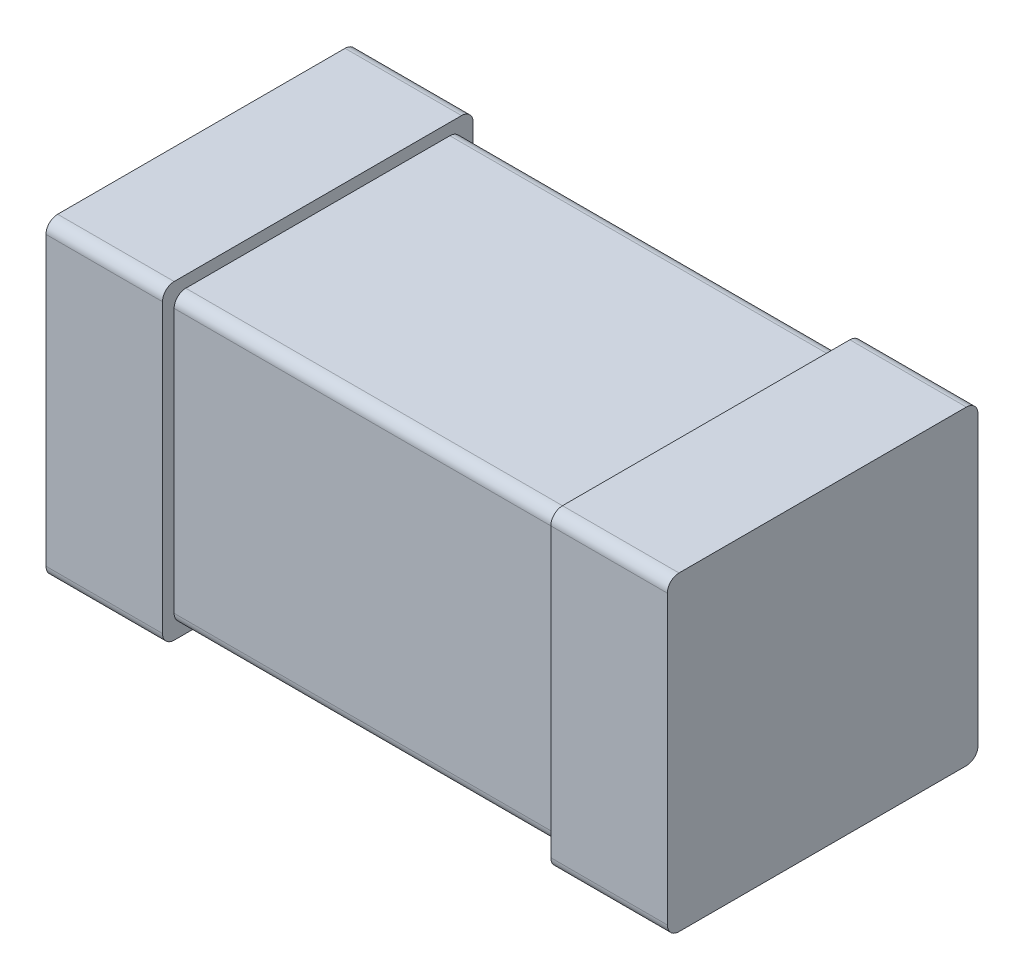
ISO-10303-21;
HEADER;
FILE_DESCRIPTION(('STEP AP214'),'2;1');
FILE_NAME('part.step','',(''),(''),'','','');
FILE_SCHEMA(('AUTOMOTIVE_DESIGN { 1 0 10303 214 1 1 1 1 }'));
ENDSEC;
DATA;
#1=APPLICATION_CONTEXT('core data for automotive mechanical design processes');
#2=APPLICATION_PROTOCOL_DEFINITION('international standard','automotive_design',2000,#1);
#3=PRODUCT_CONTEXT('',#1,'mechanical');
#4=PRODUCT('Part','Part','',(#3));
#5=PRODUCT_RELATED_PRODUCT_CATEGORY('part','',(#4));
#6=PRODUCT_DEFINITION_FORMATION('','',#4);
#7=PRODUCT_DEFINITION_CONTEXT('part definition',#1,'design');
#8=PRODUCT_DEFINITION('design','',#6,#7);
#9=PRODUCT_DEFINITION_SHAPE('','',#8);
#10=(LENGTH_UNIT() NAMED_UNIT(*) SI_UNIT(.MILLI.,.METRE.));
#11=(NAMED_UNIT(*) PLANE_ANGLE_UNIT() SI_UNIT($,.RADIAN.));
#12=(NAMED_UNIT(*) SI_UNIT($,.STERADIAN.) SOLID_ANGLE_UNIT());
#13=UNCERTAINTY_MEASURE_WITH_UNIT(LENGTH_MEASURE(1.E-05),#10,'distance_accuracy_value','');
#14=(GEOMETRIC_REPRESENTATION_CONTEXT(3) GLOBAL_UNCERTAINTY_ASSIGNED_CONTEXT((#13)) GLOBAL_UNIT_ASSIGNED_CONTEXT((#10,
#11,#12)) REPRESENTATION_CONTEXT('',''));
#15=CARTESIAN_POINT('',(0.,0.,0.));
#16=DIRECTION('',(0.,0.,1.));
#17=DIRECTION('',(1.,0.,0.));
#18=AXIS2_PLACEMENT_3D('',#15,#16,#17);
#19=CARTESIAN_POINT('',(-0.8,-0.37,0.03));
#20=DIRECTION('',(1.,0.,0.));
#21=DIRECTION('',(0.,0.,-1.));
#22=AXIS2_PLACEMENT_3D('',#19,#20,#21);
#23=CYLINDRICAL_SURFACE('',#22,0.03);
#24=CARTESIAN_POINT('',(-0.5,-0.37,0.03));
#25=DIRECTION('',(1.,0.,0.));
#26=DIRECTION('',(0.,0.,-1.));
#27=AXIS2_PLACEMENT_3D('',#24,#25,#26);
#28=CIRCLE('',#27,0.03);
#29=CARTESIAN_POINT('',(-0.5,-0.37,0.));
#30=VERTEX_POINT('',#29);
#31=CARTESIAN_POINT('',(-0.5,-0.4,0.03));
#32=VERTEX_POINT('',#31);
#33=EDGE_CURVE('E20',#30,#32,#28,.F.);
#34=ORIENTED_EDGE('',*,*,#33,.T.);
#35=DIRECTION('',(1.,0.,0.));
#36=VECTOR('',#35,1.);
#37=CARTESIAN_POINT('',(-0.8,-0.4,0.03));
#38=LINE('',#37,#36);
#39=CARTESIAN_POINT('',(-0.8,-0.4,0.03));
#40=VERTEX_POINT('',#39);
#41=EDGE_CURVE('E176',#32,#40,#38,.F.);
#42=ORIENTED_EDGE('',*,*,#41,.T.);
#43=CARTESIAN_POINT('',(-0.8,-0.37,0.03));
#44=DIRECTION('',(1.,0.,0.));
#45=DIRECTION('',(0.,0.,-1.));
#46=AXIS2_PLACEMENT_3D('',#43,#44,#45);
#47=CIRCLE('',#46,0.03);
#48=CARTESIAN_POINT('',(-0.8,-0.37,0.));
#49=VERTEX_POINT('',#48);
#50=EDGE_CURVE('E325',#40,#49,#47,.T.);
#51=ORIENTED_EDGE('',*,*,#50,.T.);
#52=DIRECTION('',(1.,0.,0.));
#53=VECTOR('',#52,1.);
#54=CARTESIAN_POINT('',(-0.8,-0.37,0.));
#55=LINE('',#54,#53);
#56=EDGE_CURVE('E178',#49,#30,#55,.T.);
#57=ORIENTED_EDGE('',*,*,#56,.T.);
#58=EDGE_LOOP('',(#34,#42,#51,#57));
#59=FACE_BOUND('',#58,.T.);
#60=ADVANCED_FACE('F17',(#59),#23,.T.);
#61=CARTESIAN_POINT('',(-0.8,0.37,0.03));
#62=DIRECTION('',(1.,0.,0.));
#63=DIRECTION('',(0.,0.,-1.));
#64=AXIS2_PLACEMENT_3D('',#61,#62,#63);
#65=CYLINDRICAL_SURFACE('',#64,0.03);
#66=DIRECTION('',(1.,0.,0.));
#67=VECTOR('',#66,1.);
#68=CARTESIAN_POINT('',(-0.8,0.37,0.));
#69=LINE('',#68,#67);
#70=CARTESIAN_POINT('',(-0.5,0.37,0.));
#71=VERTEX_POINT('',#70);
#72=CARTESIAN_POINT('',(-0.8,0.37,0.));
#73=VERTEX_POINT('',#72);
#74=EDGE_CURVE('E258',#71,#73,#69,.F.);
#75=ORIENTED_EDGE('',*,*,#74,.T.);
#76=CARTESIAN_POINT('',(-0.8,0.37,0.03));
#77=DIRECTION('',(1.,0.,0.));
#78=DIRECTION('',(0.,0.,-1.));
#79=AXIS2_PLACEMENT_3D('',#76,#77,#78);
#80=CIRCLE('',#79,0.03);
#81=CARTESIAN_POINT('',(-0.8,0.4,0.03));
#82=VERTEX_POINT('',#81);
#83=EDGE_CURVE('E322',#73,#82,#80,.T.);
#84=ORIENTED_EDGE('',*,*,#83,.T.);
#85=DIRECTION('',(1.,0.,0.));
#86=VECTOR('',#85,1.);
#87=CARTESIAN_POINT('',(-0.8,0.4,0.03));
#88=LINE('',#87,#86);
#89=CARTESIAN_POINT('',(-0.5,0.4,0.03));
#90=VERTEX_POINT('',#89);
#91=EDGE_CURVE('E255',#90,#82,#88,.F.);
#92=ORIENTED_EDGE('',*,*,#91,.F.);
#93=CARTESIAN_POINT('',(-0.5,0.37,0.03));
#94=DIRECTION('',(1.,0.,0.));
#95=DIRECTION('',(0.,0.,-1.));
#96=AXIS2_PLACEMENT_3D('',#93,#94,#95);
#97=CIRCLE('',#96,0.03);
#98=EDGE_CURVE('E180',#90,#71,#97,.F.);
#99=ORIENTED_EDGE('',*,*,#98,.T.);
#100=EDGE_LOOP('',(#75,#84,#92,#99));
#101=FACE_BOUND('',#100,.T.);
#102=ADVANCED_FACE('F329',(#101),#65,.T.);
#103=CARTESIAN_POINT('',(-0.8,-0.4,0.));
#104=DIRECTION('',(1.,0.,0.));
#105=DIRECTION('',(0.,0.,-1.));
#106=AXIS2_PLACEMENT_3D('',#103,#104,#105);
#107=PLANE('',#106);
#108=DIRECTION('',(0.,1.,0.));
#109=VECTOR('',#108,1.);
#110=CARTESIAN_POINT('',(-0.8,-0.4,0.8));
#111=LINE('',#110,#109);
#112=CARTESIAN_POINT('',(-0.8,0.37,0.8));
#113=VERTEX_POINT('',#112);
#114=CARTESIAN_POINT('',(-0.8,-0.37,0.8));
#115=VERTEX_POINT('',#114);
#116=EDGE_CURVE('E254',#113,#115,#111,.F.);
#117=ORIENTED_EDGE('',*,*,#116,.F.);
#118=CARTESIAN_POINT('',(-0.8,0.37,0.77));
#119=DIRECTION('',(1.,0.,0.));
#120=DIRECTION('',(0.,0.,-1.));
#121=AXIS2_PLACEMENT_3D('',#118,#119,#120);
#122=CIRCLE('',#121,0.03);
#123=CARTESIAN_POINT('',(-0.8,0.4,0.77));
#124=VERTEX_POINT('',#123);
#125=EDGE_CURVE('E317',#124,#113,#122,.T.);
#126=ORIENTED_EDGE('',*,*,#125,.F.);
#127=DIRECTION('',(0.,0.,1.));
#128=VECTOR('',#127,1.);
#129=CARTESIAN_POINT('',(-0.8,0.4,0.));
#130=LINE('',#129,#128);
#131=EDGE_CURVE('E257',#82,#124,#130,.T.);
#132=ORIENTED_EDGE('',*,*,#131,.F.);
#133=ORIENTED_EDGE('',*,*,#83,.F.);
#134=DIRECTION('',(0.,1.,0.));
#135=VECTOR('',#134,1.);
#136=CARTESIAN_POINT('',(-0.8,-0.4,0.));
#137=LINE('',#136,#135);
#138=EDGE_CURVE('E263',#73,#49,#137,.F.);
#139=ORIENTED_EDGE('',*,*,#138,.T.);
#140=ORIENTED_EDGE('',*,*,#50,.F.);
#141=DIRECTION('',(0.,0.,1.));
#142=VECTOR('',#141,1.);
#143=CARTESIAN_POINT('',(-0.8,-0.4,0.));
#144=LINE('',#143,#142);
#145=CARTESIAN_POINT('',(-0.8,-0.4,0.77));
#146=VERTEX_POINT('',#145);
#147=EDGE_CURVE('E188',#40,#146,#144,.T.);
#148=ORIENTED_EDGE('',*,*,#147,.T.);
#149=CARTESIAN_POINT('',(-0.8,-0.37,0.77));
#150=DIRECTION('',(1.,0.,0.));
#151=DIRECTION('',(0.,0.,-1.));
#152=AXIS2_PLACEMENT_3D('',#149,#150,#151);
#153=CIRCLE('',#152,0.03);
#154=EDGE_CURVE('E319',#115,#146,#153,.T.);
#155=ORIENTED_EDGE('',*,*,#154,.F.);
#156=EDGE_LOOP('',(#117,#126,#132,#133,#139,#140,#148,#155));
#157=FACE_BOUND('',#156,.T.);
#158=ADVANCED_FACE('F337',(#157),#107,.F.);
#159=CARTESIAN_POINT('',(-0.8,-0.37,0.77));
#160=DIRECTION('',(1.,0.,0.));
#161=DIRECTION('',(0.,0.,-1.));
#162=AXIS2_PLACEMENT_3D('',#159,#160,#161);
#163=CYLINDRICAL_SURFACE('',#162,0.03);
#164=DIRECTION('',(1.,0.,0.));
#165=VECTOR('',#164,1.);
#166=CARTESIAN_POINT('',(-0.8,-0.37,0.8));
#167=LINE('',#166,#165);
#168=CARTESIAN_POINT('',(-0.5,-0.37,0.8));
#169=VERTEX_POINT('',#168);
#170=EDGE_CURVE('E251',#115,#169,#167,.T.);
#171=ORIENTED_EDGE('',*,*,#170,.F.);
#172=ORIENTED_EDGE('',*,*,#154,.T.);
#173=DIRECTION('',(1.,0.,0.));
#174=VECTOR('',#173,1.);
#175=CARTESIAN_POINT('',(-0.8,-0.4,0.77));
#176=LINE('',#175,#174);
#177=CARTESIAN_POINT('',(-0.5,-0.4,0.77));
#178=VERTEX_POINT('',#177);
#179=EDGE_CURVE('E266',#146,#178,#176,.T.);
#180=ORIENTED_EDGE('',*,*,#179,.T.);
#181=CARTESIAN_POINT('',(-0.5,-0.37,0.77));
#182=DIRECTION('',(1.,0.,0.));
#183=DIRECTION('',(0.,0.,-1.));
#184=AXIS2_PLACEMENT_3D('',#181,#182,#183);
#185=CIRCLE('',#184,0.03);
#186=EDGE_CURVE('E193',#178,#169,#185,.F.);
#187=ORIENTED_EDGE('',*,*,#186,.T.);
#188=EDGE_LOOP('',(#171,#172,#180,#187));
#189=FACE_BOUND('',#188,.T.);
#190=ADVANCED_FACE('F480',(#189),#163,.T.);
#191=CARTESIAN_POINT('',(-0.8,0.37,0.77));
#192=DIRECTION('',(1.,0.,0.));
#193=DIRECTION('',(0.,0.,-1.));
#194=AXIS2_PLACEMENT_3D('',#191,#192,#193);
#195=CYLINDRICAL_SURFACE('',#194,0.03);
#196=CARTESIAN_POINT('',(-0.5,0.37,0.77));
#197=DIRECTION('',(1.,0.,0.));
#198=DIRECTION('',(0.,0.,-1.));
#199=AXIS2_PLACEMENT_3D('',#196,#197,#198);
#200=CIRCLE('',#199,0.03);
#201=CARTESIAN_POINT('',(-0.5,0.37,0.8));
#202=VERTEX_POINT('',#201);
#203=CARTESIAN_POINT('',(-0.5,0.4,0.77));
#204=VERTEX_POINT('',#203);
#205=EDGE_CURVE('E315',#202,#204,#200,.F.);
#206=ORIENTED_EDGE('',*,*,#205,.T.);
#207=DIRECTION('',(1.,0.,0.));
#208=VECTOR('',#207,1.);
#209=CARTESIAN_POINT('',(-0.8,0.4,0.77));
#210=LINE('',#209,#208);
#211=EDGE_CURVE('E259',#124,#204,#210,.T.);
#212=ORIENTED_EDGE('',*,*,#211,.F.);
#213=ORIENTED_EDGE('',*,*,#125,.T.);
#214=DIRECTION('',(1.,0.,0.));
#215=VECTOR('',#214,1.);
#216=CARTESIAN_POINT('',(-0.8,0.37,0.8));
#217=LINE('',#216,#215);
#218=EDGE_CURVE('E248',#202,#113,#217,.F.);
#219=ORIENTED_EDGE('',*,*,#218,.F.);
#220=EDGE_LOOP('',(#206,#212,#213,#219));
#221=FACE_BOUND('',#220,.T.);
#222=ADVANCED_FACE('F476',(#221),#195,.T.);
#223=CARTESIAN_POINT('',(0.5,-0.37,0.03));
#224=DIRECTION('',(1.,0.,0.));
#225=DIRECTION('',(0.,0.,-1.));
#226=AXIS2_PLACEMENT_3D('',#223,#224,#225);
#227=CYLINDRICAL_SURFACE('',#226,0.03);
#228=CARTESIAN_POINT('',(0.8,-0.37,0.03));
#229=DIRECTION('',(1.,0.,0.));
#230=DIRECTION('',(0.,0.,-1.));
#231=AXIS2_PLACEMENT_3D('',#228,#229,#230);
#232=CIRCLE('',#231,0.03);
#233=CARTESIAN_POINT('',(0.8,-0.4,0.03));
#234=VERTEX_POINT('',#233);
#235=CARTESIAN_POINT('',(0.8,-0.37,0.));
#236=VERTEX_POINT('',#235);
#237=EDGE_CURVE('E307',#234,#236,#232,.T.);
#238=ORIENTED_EDGE('',*,*,#237,.F.);
#239=DIRECTION('',(1.,0.,0.));
#240=VECTOR('',#239,1.);
#241=CARTESIAN_POINT('',(0.5,-0.4,0.03));
#242=LINE('',#241,#240);
#243=CARTESIAN_POINT('',(0.5,-0.4,0.03));
#244=VERTEX_POINT('',#243);
#245=EDGE_CURVE('E244',#234,#244,#242,.F.);
#246=ORIENTED_EDGE('',*,*,#245,.T.);
#247=CARTESIAN_POINT('',(0.5,-0.37,0.03));
#248=DIRECTION('',(1.,0.,0.));
#249=DIRECTION('',(0.,0.,-1.));
#250=AXIS2_PLACEMENT_3D('',#247,#248,#249);
#251=CIRCLE('',#250,0.03);
#252=CARTESIAN_POINT('',(0.5,-0.37,0.));
#253=VERTEX_POINT('',#252);
#254=EDGE_CURVE('E313',#244,#253,#251,.T.);
#255=ORIENTED_EDGE('',*,*,#254,.T.);
#256=DIRECTION('',(1.,0.,0.));
#257=VECTOR('',#256,1.);
#258=CARTESIAN_POINT('',(0.5,-0.37,0.));
#259=LINE('',#258,#257);
#260=EDGE_CURVE('E234',#253,#236,#259,.T.);
#261=ORIENTED_EDGE('',*,*,#260,.T.);
#262=EDGE_LOOP('',(#238,#246,#255,#261));
#263=FACE_BOUND('',#262,.T.);
#264=ADVANCED_FACE('F472',(#263),#227,.T.);
#265=CARTESIAN_POINT('',(0.5,0.37,0.03));
#266=DIRECTION('',(1.,0.,0.));
#267=DIRECTION('',(0.,0.,-1.));
#268=AXIS2_PLACEMENT_3D('',#265,#266,#267);
#269=CYLINDRICAL_SURFACE('',#268,0.03);
#270=DIRECTION('',(1.,0.,0.));
#271=VECTOR('',#270,1.);
#272=CARTESIAN_POINT('',(0.5,0.37,0.));
#273=LINE('',#272,#271);
#274=CARTESIAN_POINT('',(0.8,0.37,0.));
#275=VERTEX_POINT('',#274);
#276=CARTESIAN_POINT('',(0.5,0.37,0.));
#277=VERTEX_POINT('',#276);
#278=EDGE_CURVE('E239',#275,#277,#273,.F.);
#279=ORIENTED_EDGE('',*,*,#278,.T.);
#280=CARTESIAN_POINT('',(0.5,0.37,0.03));
#281=DIRECTION('',(1.,0.,0.));
#282=DIRECTION('',(0.,0.,-1.));
#283=AXIS2_PLACEMENT_3D('',#280,#281,#282);
#284=CIRCLE('',#283,0.03);
#285=CARTESIAN_POINT('',(0.5,0.4,0.03));
#286=VERTEX_POINT('',#285);
#287=EDGE_CURVE('E311',#277,#286,#284,.T.);
#288=ORIENTED_EDGE('',*,*,#287,.T.);
#289=DIRECTION('',(1.,0.,0.));
#290=VECTOR('',#289,1.);
#291=CARTESIAN_POINT('',(0.5,0.4,0.03));
#292=LINE('',#291,#290);
#293=CARTESIAN_POINT('',(0.8,0.4,0.03));
#294=VERTEX_POINT('',#293);
#295=EDGE_CURVE('E228',#294,#286,#292,.F.);
#296=ORIENTED_EDGE('',*,*,#295,.F.);
#297=CARTESIAN_POINT('',(0.8,0.37,0.03));
#298=DIRECTION('',(1.,0.,0.));
#299=DIRECTION('',(0.,0.,-1.));
#300=AXIS2_PLACEMENT_3D('',#297,#298,#299);
#301=CIRCLE('',#300,0.03);
#302=EDGE_CURVE('E305',#275,#294,#301,.T.);
#303=ORIENTED_EDGE('',*,*,#302,.F.);
#304=EDGE_LOOP('',(#279,#288,#296,#303));
#305=FACE_BOUND('',#304,.T.);
#306=ADVANCED_FACE('F468',(#305),#269,.T.);
#307=CARTESIAN_POINT('',(0.5,-0.37,0.77));
#308=DIRECTION('',(1.,0.,0.));
#309=DIRECTION('',(0.,0.,-1.));
#310=AXIS2_PLACEMENT_3D('',#307,#308,#309);
#311=CYLINDRICAL_SURFACE('',#310,0.03);
#312=DIRECTION('',(1.,0.,0.));
#313=VECTOR('',#312,1.);
#314=CARTESIAN_POINT('',(0.5,-0.37,0.8));
#315=LINE('',#314,#313);
#316=CARTESIAN_POINT('',(0.5,-0.37,0.8));
#317=VERTEX_POINT('',#316);
#318=CARTESIAN_POINT('',(0.8,-0.37,0.8));
#319=VERTEX_POINT('',#318);
#320=EDGE_CURVE('E225',#317,#319,#315,.T.);
#321=ORIENTED_EDGE('',*,*,#320,.F.);
#322=CARTESIAN_POINT('',(0.5,-0.37,0.77));
#323=DIRECTION('',(1.,0.,0.));
#324=DIRECTION('',(0.,0.,-1.));
#325=AXIS2_PLACEMENT_3D('',#322,#323,#324);
#326=CIRCLE('',#325,0.03);
#327=CARTESIAN_POINT('',(0.5,-0.4,0.77));
#328=VERTEX_POINT('',#327);
#329=EDGE_CURVE('E309',#317,#328,#326,.T.);
#330=ORIENTED_EDGE('',*,*,#329,.T.);
#331=DIRECTION('',(1.,0.,0.));
#332=VECTOR('',#331,1.);
#333=CARTESIAN_POINT('',(0.5,-0.4,0.77));
#334=LINE('',#333,#332);
#335=CARTESIAN_POINT('',(0.8,-0.4,0.77));
#336=VERTEX_POINT('',#335);
#337=EDGE_CURVE('E238',#328,#336,#334,.T.);
#338=ORIENTED_EDGE('',*,*,#337,.T.);
#339=CARTESIAN_POINT('',(0.8,-0.37,0.77));
#340=DIRECTION('',(1.,0.,0.));
#341=DIRECTION('',(0.,0.,-1.));
#342=AXIS2_PLACEMENT_3D('',#339,#340,#341);
#343=CIRCLE('',#342,0.03);
#344=EDGE_CURVE('E303',#319,#336,#343,.T.);
#345=ORIENTED_EDGE('',*,*,#344,.F.);
#346=EDGE_LOOP('',(#321,#330,#338,#345));
#347=FACE_BOUND('',#346,.T.);
#348=ADVANCED_FACE('F464',(#347),#311,.T.);
#349=CARTESIAN_POINT('',(0.8,-0.4,0.));
#350=DIRECTION('',(1.,0.,0.));
#351=DIRECTION('',(0.,0.,-1.));
#352=AXIS2_PLACEMENT_3D('',#349,#350,#351);
#353=PLANE('',#352);
#354=DIRECTION('',(0.,1.,0.));
#355=VECTOR('',#354,1.);
#356=CARTESIAN_POINT('',(0.8,-0.4,0.8));
#357=LINE('',#356,#355);
#358=CARTESIAN_POINT('',(0.8,0.37,0.8));
#359=VERTEX_POINT('',#358);
#360=EDGE_CURVE('E224',#319,#359,#357,.T.);
#361=ORIENTED_EDGE('',*,*,#360,.F.);
#362=ORIENTED_EDGE('',*,*,#344,.T.);
#363=DIRECTION('',(0.,0.,1.));
#364=VECTOR('',#363,1.);
#365=CARTESIAN_POINT('',(0.8,-0.4,0.));
#366=LINE('',#365,#364);
#367=EDGE_CURVE('E247',#336,#234,#366,.F.);
#368=ORIENTED_EDGE('',*,*,#367,.T.);
#369=ORIENTED_EDGE('',*,*,#237,.T.);
#370=DIRECTION('',(0.,1.,0.));
#371=VECTOR('',#370,1.);
#372=CARTESIAN_POINT('',(0.8,-0.4,0.));
#373=LINE('',#372,#371);
#374=EDGE_CURVE('E237',#236,#275,#373,.T.);
#375=ORIENTED_EDGE('',*,*,#374,.T.);
#376=ORIENTED_EDGE('',*,*,#302,.T.);
#377=DIRECTION('',(0.,0.,1.));
#378=VECTOR('',#377,1.);
#379=CARTESIAN_POINT('',(0.8,0.4,0.));
#380=LINE('',#379,#378);
#381=CARTESIAN_POINT('',(0.8,0.4,0.77));
#382=VERTEX_POINT('',#381);
#383=EDGE_CURVE('E231',#382,#294,#380,.F.);
#384=ORIENTED_EDGE('',*,*,#383,.F.);
#385=CARTESIAN_POINT('',(0.8,0.37,0.77));
#386=DIRECTION('',(1.,0.,0.));
#387=DIRECTION('',(0.,0.,-1.));
#388=AXIS2_PLACEMENT_3D('',#385,#386,#387);
#389=CIRCLE('',#388,0.03);
#390=EDGE_CURVE('E299',#359,#382,#389,.F.);
#391=ORIENTED_EDGE('',*,*,#390,.F.);
#392=EDGE_LOOP('',(#361,#362,#368,#369,#375,#376,#384,#391));
#393=FACE_BOUND('',#392,.T.);
#394=ADVANCED_FACE('F460',(#393),#353,.T.);
#395=CARTESIAN_POINT('',(0.5,0.37,0.77));
#396=DIRECTION('',(1.,0.,0.));
#397=DIRECTION('',(0.,0.,-1.));
#398=AXIS2_PLACEMENT_3D('',#395,#396,#397);
#399=CYLINDRICAL_SURFACE('',#398,0.03);
#400=ORIENTED_EDGE('',*,*,#390,.T.);
#401=DIRECTION('',(1.,0.,0.));
#402=VECTOR('',#401,1.);
#403=CARTESIAN_POINT('',(0.5,0.4,0.77));
#404=LINE('',#403,#402);
#405=CARTESIAN_POINT('',(0.5,0.4,0.77));
#406=VERTEX_POINT('',#405);
#407=EDGE_CURVE('E227',#406,#382,#404,.T.);
#408=ORIENTED_EDGE('',*,*,#407,.F.);
#409=CARTESIAN_POINT('',(0.5,0.37,0.77));
#410=DIRECTION('',(1.,0.,0.));
#411=DIRECTION('',(0.,0.,-1.));
#412=AXIS2_PLACEMENT_3D('',#409,#410,#411);
#413=CIRCLE('',#412,0.03);
#414=CARTESIAN_POINT('',(0.5,0.37,0.8));
#415=VERTEX_POINT('',#414);
#416=EDGE_CURVE('E301',#406,#415,#413,.T.);
#417=ORIENTED_EDGE('',*,*,#416,.T.);
#418=DIRECTION('',(1.,0.,0.));
#419=VECTOR('',#418,1.);
#420=CARTESIAN_POINT('',(0.5,0.37,0.8));
#421=LINE('',#420,#419);
#422=EDGE_CURVE('E216',#359,#415,#421,.F.);
#423=ORIENTED_EDGE('',*,*,#422,.F.);
#424=EDGE_LOOP('',(#400,#408,#417,#423));
#425=FACE_BOUND('',#424,.T.);
#426=ADVANCED_FACE('F456',(#425),#399,.T.);
#427=CARTESIAN_POINT('',(-0.5,-0.34,0.74));
#428=DIRECTION('',(1.,0.,0.));
#429=DIRECTION('',(0.,0.,-1.));
#430=AXIS2_PLACEMENT_3D('',#427,#428,#429);
#431=CYLINDRICAL_SURFACE('',#430,0.03);
#432=DIRECTION('',(1.,0.,0.));
#433=VECTOR('',#432,1.);
#434=CARTESIAN_POINT('',(-0.5,-0.34,0.77));
#435=LINE('',#434,#433);
#436=CARTESIAN_POINT('',(-0.5,-0.34,0.77));
#437=VERTEX_POINT('',#436);
#438=CARTESIAN_POINT('',(0.5,-0.34,0.77));
#439=VERTEX_POINT('',#438);
#440=EDGE_CURVE('E208',#437,#439,#435,.T.);
#441=ORIENTED_EDGE('',*,*,#440,.F.);
#442=CARTESIAN_POINT('',(-0.5,-0.34,0.74));
#443=DIRECTION('',(1.,0.,0.));
#444=DIRECTION('',(0.,0.,-1.));
#445=AXIS2_PLACEMENT_3D('',#442,#443,#444);
#446=CIRCLE('',#445,0.03);
#447=CARTESIAN_POINT('',(-0.5,-0.37,0.74));
#448=VERTEX_POINT('',#447);
#449=EDGE_CURVE('E295',#437,#448,#446,.T.);
#450=ORIENTED_EDGE('',*,*,#449,.T.);
#451=DIRECTION('',(1.,0.,0.));
#452=VECTOR('',#451,1.);
#453=CARTESIAN_POINT('',(-0.5,-0.37,0.74));
#454=LINE('',#453,#452);
#455=CARTESIAN_POINT('',(0.5,-0.37,0.74));
#456=VERTEX_POINT('',#455);
#457=EDGE_CURVE('E211',#448,#456,#454,.T.);
#458=ORIENTED_EDGE('',*,*,#457,.T.);
#459=CARTESIAN_POINT('',(0.5,-0.34,0.74));
#460=DIRECTION('',(1.,0.,0.));
#461=DIRECTION('',(0.,0.,-1.));
#462=AXIS2_PLACEMENT_3D('',#459,#460,#461);
#463=CIRCLE('',#462,0.03);
#464=EDGE_CURVE('E297',#456,#439,#463,.F.);
#465=ORIENTED_EDGE('',*,*,#464,.T.);
#466=EDGE_LOOP('',(#441,#450,#458,#465));
#467=FACE_BOUND('',#466,.T.);
#468=ADVANCED_FACE('F452',(#467),#431,.T.);
#469=CARTESIAN_POINT('',(-0.5,0.34,0.74));
#470=DIRECTION('',(1.,0.,0.));
#471=DIRECTION('',(0.,0.,-1.));
#472=AXIS2_PLACEMENT_3D('',#469,#470,#471);
#473=CYLINDRICAL_SURFACE('',#472,0.03);
#474=CARTESIAN_POINT('',(0.5,0.34,0.74));
#475=DIRECTION('',(1.,0.,0.));
#476=DIRECTION('',(0.,0.,-1.));
#477=AXIS2_PLACEMENT_3D('',#474,#475,#476);
#478=CIRCLE('',#477,0.03);
#479=CARTESIAN_POINT('',(0.5,0.34,0.77));
#480=VERTEX_POINT('',#479);
#481=CARTESIAN_POINT('',(0.5,0.37,0.74));
#482=VERTEX_POINT('',#481);
#483=EDGE_CURVE('E189',#480,#482,#478,.F.);
#484=ORIENTED_EDGE('',*,*,#483,.T.);
#485=DIRECTION('',(1.,0.,0.));
#486=VECTOR('',#485,1.);
#487=CARTESIAN_POINT('',(-0.5,0.37,0.74));
#488=LINE('',#487,#486);
#489=CARTESIAN_POINT('',(-0.5,0.37,0.74));
#490=VERTEX_POINT('',#489);
#491=EDGE_CURVE('E196',#490,#482,#488,.T.);
#492=ORIENTED_EDGE('',*,*,#491,.F.);
#493=CARTESIAN_POINT('',(-0.5,0.34,0.74));
#494=DIRECTION('',(1.,0.,0.));
#495=DIRECTION('',(0.,0.,-1.));
#496=AXIS2_PLACEMENT_3D('',#493,#494,#495);
#497=CIRCLE('',#496,0.03);
#498=CARTESIAN_POINT('',(-0.5,0.34,0.77));
#499=VERTEX_POINT('',#498);
#500=EDGE_CURVE('E293',#490,#499,#497,.T.);
#501=ORIENTED_EDGE('',*,*,#500,.T.);
#502=DIRECTION('',(1.,0.,0.));
#503=VECTOR('',#502,1.);
#504=CARTESIAN_POINT('',(-0.5,0.34,0.77));
#505=LINE('',#504,#503);
#506=EDGE_CURVE('E201',#480,#499,#505,.F.);
#507=ORIENTED_EDGE('',*,*,#506,.F.);
#508=EDGE_LOOP('',(#484,#492,#501,#507));
#509=FACE_BOUND('',#508,.T.);
#510=ADVANCED_FACE('F449',(#509),#473,.T.);
#511=CARTESIAN_POINT('',(-0.8,-0.4,0.));
#512=DIRECTION('',(0.,1.,0.));
#513=DIRECTION('',(0.,0.,1.));
#514=AXIS2_PLACEMENT_3D('',#511,#512,#513);
#515=PLANE('',#514);
#516=ORIENTED_EDGE('',*,*,#147,.F.);
#517=ORIENTED_EDGE('',*,*,#41,.F.);
#518=DIRECTION('',(0.,0.,-1.));
#519=VECTOR('',#518,1.);
#520=CARTESIAN_POINT('',(-0.5,-0.4,0.));
#521=LINE('',#520,#519);
#522=EDGE_CURVE('E186',#178,#32,#521,.T.);
#523=ORIENTED_EDGE('',*,*,#522,.F.);
#524=ORIENTED_EDGE('',*,*,#179,.F.);
#525=EDGE_LOOP('',(#516,#517,#523,#524));
#526=FACE_BOUND('',#525,.T.);
#527=ADVANCED_FACE('F184',(#526),#515,.F.);
#528=CARTESIAN_POINT('',(-0.8,-0.4,0.));
#529=DIRECTION('',(0.,0.,1.));
#530=DIRECTION('',(1.,0.,0.));
#531=AXIS2_PLACEMENT_3D('',#528,#529,#530);
#532=PLANE('',#531);
#533=DIRECTION('',(0.,1.,0.));
#534=VECTOR('',#533,1.);
#535=CARTESIAN_POINT('',(-0.5,-0.4,0.));
#536=LINE('',#535,#534);
#537=EDGE_CURVE('E195',#30,#71,#536,.T.);
#538=ORIENTED_EDGE('',*,*,#537,.F.);
#539=ORIENTED_EDGE('',*,*,#56,.F.);
#540=ORIENTED_EDGE('',*,*,#138,.F.);
#541=ORIENTED_EDGE('',*,*,#74,.F.);
#542=EDGE_LOOP('',(#538,#539,#540,#541));
#543=FACE_BOUND('',#542,.T.);
#544=ADVANCED_FACE('F334',(#543),#532,.F.);
#545=CARTESIAN_POINT('',(-0.8,0.4,0.));
#546=DIRECTION('',(0.,1.,0.));
#547=DIRECTION('',(0.,0.,1.));
#548=AXIS2_PLACEMENT_3D('',#545,#546,#547);
#549=PLANE('',#548);
#550=ORIENTED_EDGE('',*,*,#131,.T.);
#551=ORIENTED_EDGE('',*,*,#211,.T.);
#552=DIRECTION('',(0.,0.,-1.));
#553=VECTOR('',#552,1.);
#554=CARTESIAN_POINT('',(-0.5,0.4,0.));
#555=LINE('',#554,#553);
#556=EDGE_CURVE('E198',#90,#204,#555,.F.);
#557=ORIENTED_EDGE('',*,*,#556,.F.);
#558=ORIENTED_EDGE('',*,*,#91,.T.);
#559=EDGE_LOOP('',(#550,#551,#557,#558));
#560=FACE_BOUND('',#559,.T.);
#561=ADVANCED_FACE('F342',(#560),#549,.T.);
#562=CARTESIAN_POINT('',(-0.8,-0.4,0.8));
#563=DIRECTION('',(0.,0.,1.));
#564=DIRECTION('',(1.,0.,0.));
#565=AXIS2_PLACEMENT_3D('',#562,#563,#564);
#566=PLANE('',#565);
#567=DIRECTION('',(0.,1.,0.));
#568=VECTOR('',#567,1.);
#569=CARTESIAN_POINT('',(-0.5,-0.4,0.8));
#570=LINE('',#569,#568);
#571=EDGE_CURVE('E343',#202,#169,#570,.F.);
#572=ORIENTED_EDGE('',*,*,#571,.F.);
#573=ORIENTED_EDGE('',*,*,#218,.T.);
#574=ORIENTED_EDGE('',*,*,#116,.T.);
#575=ORIENTED_EDGE('',*,*,#170,.T.);
#576=EDGE_LOOP('',(#572,#573,#574,#575));
#577=FACE_BOUND('',#576,.T.);
#578=ADVANCED_FACE('F438',(#577),#566,.T.);
#579=CARTESIAN_POINT('',(0.5,-0.4,0.));
#580=DIRECTION('',(0.,1.,0.));
#581=DIRECTION('',(0.,0.,1.));
#582=AXIS2_PLACEMENT_3D('',#579,#580,#581);
#583=PLANE('',#582);
#584=DIRECTION('',(0.,0.,-1.));
#585=VECTOR('',#584,1.);
#586=CARTESIAN_POINT('',(0.5,-0.4,0.));
#587=LINE('',#586,#585);
#588=EDGE_CURVE('E220',#328,#244,#587,.T.);
#589=ORIENTED_EDGE('',*,*,#588,.T.);
#590=ORIENTED_EDGE('',*,*,#245,.F.);
#591=ORIENTED_EDGE('',*,*,#367,.F.);
#592=ORIENTED_EDGE('',*,*,#337,.F.);
#593=EDGE_LOOP('',(#589,#590,#591,#592));
#594=FACE_BOUND('',#593,.T.);
#595=ADVANCED_FACE('F434',(#594),#583,.F.);
#596=CARTESIAN_POINT('',(0.5,-0.4,0.));
#597=DIRECTION('',(0.,0.,1.));
#598=DIRECTION('',(1.,0.,0.));
#599=AXIS2_PLACEMENT_3D('',#596,#597,#598);
#600=PLANE('',#599);
#601=ORIENTED_EDGE('',*,*,#374,.F.);
#602=ORIENTED_EDGE('',*,*,#260,.F.);
#603=DIRECTION('',(0.,1.,0.));
#604=VECTOR('',#603,1.);
#605=CARTESIAN_POINT('',(0.5,-0.4,0.));
#606=LINE('',#605,#604);
#607=EDGE_CURVE('E363',#253,#277,#606,.T.);
#608=ORIENTED_EDGE('',*,*,#607,.T.);
#609=ORIENTED_EDGE('',*,*,#278,.F.);
#610=EDGE_LOOP('',(#601,#602,#608,#609));
#611=FACE_BOUND('',#610,.T.);
#612=ADVANCED_FACE('F430',(#611),#600,.F.);
#613=CARTESIAN_POINT('',(0.5,0.4,0.));
#614=DIRECTION('',(0.,1.,0.));
#615=DIRECTION('',(0.,0.,1.));
#616=AXIS2_PLACEMENT_3D('',#613,#614,#615);
#617=PLANE('',#616);
#618=DIRECTION('',(0.,0.,-1.));
#619=VECTOR('',#618,1.);
#620=CARTESIAN_POINT('',(0.5,0.4,0.));
#621=LINE('',#620,#619);
#622=EDGE_CURVE('E366',#286,#406,#621,.F.);
#623=ORIENTED_EDGE('',*,*,#622,.T.);
#624=ORIENTED_EDGE('',*,*,#407,.T.);
#625=ORIENTED_EDGE('',*,*,#383,.T.);
#626=ORIENTED_EDGE('',*,*,#295,.T.);
#627=EDGE_LOOP('',(#623,#624,#625,#626));
#628=FACE_BOUND('',#627,.T.);
#629=ADVANCED_FACE('F426',(#628),#617,.T.);
#630=CARTESIAN_POINT('',(0.5,-0.4,0.8));
#631=DIRECTION('',(0.,0.,1.));
#632=DIRECTION('',(1.,0.,0.));
#633=AXIS2_PLACEMENT_3D('',#630,#631,#632);
#634=PLANE('',#633);
#635=ORIENTED_EDGE('',*,*,#360,.T.);
#636=ORIENTED_EDGE('',*,*,#422,.T.);
#637=DIRECTION('',(0.,1.,0.));
#638=VECTOR('',#637,1.);
#639=CARTESIAN_POINT('',(0.5,-0.4,0.8));
#640=LINE('',#639,#638);
#641=EDGE_CURVE('E289',#415,#317,#640,.F.);
#642=ORIENTED_EDGE('',*,*,#641,.T.);
#643=ORIENTED_EDGE('',*,*,#320,.T.);
#644=EDGE_LOOP('',(#635,#636,#642,#643));
#645=FACE_BOUND('',#644,.T.);
#646=ADVANCED_FACE('F422',(#645),#634,.T.);
#647=CARTESIAN_POINT('',(-0.5,-0.37,0.03));
#648=DIRECTION('',(0.,1.,0.));
#649=DIRECTION('',(0.,0.,1.));
#650=AXIS2_PLACEMENT_3D('',#647,#648,#649);
#651=PLANE('',#650);
#652=DIRECTION('',(0.,0.,-1.));
#653=VECTOR('',#652,1.);
#654=CARTESIAN_POINT('',(-0.5,-0.37,0.));
#655=LINE('',#654,#653);
#656=CARTESIAN_POINT('',(-0.5,-0.37,0.06));
#657=VERTEX_POINT('',#656);
#658=EDGE_CURVE('E344',#657,#448,#655,.F.);
#659=ORIENTED_EDGE('',*,*,#658,.F.);
#660=DIRECTION('',(1.,0.,0.));
#661=VECTOR('',#660,1.);
#662=CARTESIAN_POINT('',(-0.5,-0.37,0.06));
#663=LINE('',#662,#661);
#664=CARTESIAN_POINT('',(0.5,-0.37,0.06));
#665=VERTEX_POINT('',#664);
#666=EDGE_CURVE('E217',#665,#657,#663,.F.);
#667=ORIENTED_EDGE('',*,*,#666,.F.);
#668=DIRECTION('',(0.,0.,-1.));
#669=VECTOR('',#668,1.);
#670=CARTESIAN_POINT('',(0.5,-0.37,0.));
#671=LINE('',#670,#669);
#672=EDGE_CURVE('E288',#665,#456,#671,.F.);
#673=ORIENTED_EDGE('',*,*,#672,.T.);
#674=ORIENTED_EDGE('',*,*,#457,.F.);
#675=EDGE_LOOP('',(#659,#667,#673,#674));
#676=FACE_BOUND('',#675,.T.);
#677=ADVANCED_FACE('F418',(#676),#651,.F.);
#678=CARTESIAN_POINT('',(-0.5,-0.37,0.77));
#679=DIRECTION('',(0.,0.,1.));
#680=DIRECTION('',(1.,0.,0.));
#681=AXIS2_PLACEMENT_3D('',#678,#679,#680);
#682=PLANE('',#681);
#683=DIRECTION('',(0.,1.,0.));
#684=VECTOR('',#683,1.);
#685=CARTESIAN_POINT('',(0.5,-0.4,0.77));
#686=LINE('',#685,#684);
#687=EDGE_CURVE('E373',#439,#480,#686,.T.);
#688=ORIENTED_EDGE('',*,*,#687,.T.);
#689=ORIENTED_EDGE('',*,*,#506,.T.);
#690=DIRECTION('',(0.,1.,0.));
#691=VECTOR('',#690,1.);
#692=CARTESIAN_POINT('',(-0.5,-0.4,0.77));
#693=LINE('',#692,#691);
#694=EDGE_CURVE('E349',#437,#499,#693,.T.);
#695=ORIENTED_EDGE('',*,*,#694,.F.);
#696=ORIENTED_EDGE('',*,*,#440,.T.);
#697=EDGE_LOOP('',(#688,#689,#695,#696));
#698=FACE_BOUND('',#697,.T.);
#699=ADVANCED_FACE('F415',(#698),#682,.T.);
#700=CARTESIAN_POINT('',(-0.5,0.37,0.03));
#701=DIRECTION('',(0.,1.,0.));
#702=DIRECTION('',(0.,0.,1.));
#703=AXIS2_PLACEMENT_3D('',#700,#701,#702);
#704=PLANE('',#703);
#705=DIRECTION('',(0.,0.,-1.));
#706=VECTOR('',#705,1.);
#707=CARTESIAN_POINT('',(-0.5,0.37,0.));
#708=LINE('',#707,#706);
#709=CARTESIAN_POINT('',(-0.5,0.37,0.06));
#710=VERTEX_POINT('',#709);
#711=EDGE_CURVE('E291',#490,#710,#708,.T.);
#712=ORIENTED_EDGE('',*,*,#711,.F.);
#713=ORIENTED_EDGE('',*,*,#491,.T.);
#714=DIRECTION('',(0.,0.,-1.));
#715=VECTOR('',#714,1.);
#716=CARTESIAN_POINT('',(0.5,0.37,0.));
#717=LINE('',#716,#715);
#718=CARTESIAN_POINT('',(0.5,0.37,0.06));
#719=VERTEX_POINT('',#718);
#720=EDGE_CURVE('E206',#482,#719,#717,.T.);
#721=ORIENTED_EDGE('',*,*,#720,.T.);
#722=DIRECTION('',(1.,0.,0.));
#723=VECTOR('',#722,1.);
#724=CARTESIAN_POINT('',(-0.5,0.37,0.06));
#725=LINE('',#724,#723);
#726=EDGE_CURVE('E205',#710,#719,#725,.T.);
#727=ORIENTED_EDGE('',*,*,#726,.F.);
#728=EDGE_LOOP('',(#712,#713,#721,#727));
#729=FACE_BOUND('',#728,.T.);
#730=ADVANCED_FACE('F381',(#729),#704,.T.);
#731=CARTESIAN_POINT('',(-0.5,-0.4,0.));
#732=DIRECTION('',(1.,0.,0.));
#733=DIRECTION('',(0.,0.,-1.));
#734=AXIS2_PLACEMENT_3D('',#731,#732,#733);
#735=PLANE('',#734);
#736=CARTESIAN_POINT('',(-0.5,0.34,0.06));
#737=DIRECTION('',(1.,0.,0.));
#738=DIRECTION('',(0.,0.,-1.));
#739=AXIS2_PLACEMENT_3D('',#736,#737,#738);
#740=CIRCLE('',#739,0.03);
#741=CARTESIAN_POINT('',(-0.5,0.34,0.03));
#742=VERTEX_POINT('',#741);
#743=EDGE_CURVE('E280',#742,#710,#740,.T.);
#744=ORIENTED_EDGE('',*,*,#743,.F.);
#745=DIRECTION('',(0.,1.,0.));
#746=VECTOR('',#745,1.);
#747=CARTESIAN_POINT('',(-0.5,-0.37,0.03));
#748=LINE('',#747,#746);
#749=CARTESIAN_POINT('',(-0.5,-0.34,0.03));
#750=VERTEX_POINT('',#749);
#751=EDGE_CURVE('E283',#742,#750,#748,.F.);
#752=ORIENTED_EDGE('',*,*,#751,.T.);
#753=CARTESIAN_POINT('',(-0.5,-0.34,0.06));
#754=DIRECTION('',(1.,0.,0.));
#755=DIRECTION('',(0.,0.,-1.));
#756=AXIS2_PLACEMENT_3D('',#753,#754,#755);
#757=CIRCLE('',#756,0.03);
#758=EDGE_CURVE('E221',#657,#750,#757,.T.);
#759=ORIENTED_EDGE('',*,*,#758,.F.);
#760=ORIENTED_EDGE('',*,*,#658,.T.);
#761=ORIENTED_EDGE('',*,*,#449,.F.);
#762=ORIENTED_EDGE('',*,*,#694,.T.);
#763=ORIENTED_EDGE('',*,*,#500,.F.);
#764=ORIENTED_EDGE('',*,*,#711,.T.);
#765=EDGE_LOOP('',(#744,#752,#759,#760,#761,#762,#763,#764));
#766=FACE_BOUND('',#765,.T.);
#767=ORIENTED_EDGE('',*,*,#571,.T.);
#768=ORIENTED_EDGE('',*,*,#186,.F.);
#769=ORIENTED_EDGE('',*,*,#522,.T.);
#770=ORIENTED_EDGE('',*,*,#33,.F.);
#771=ORIENTED_EDGE('',*,*,#537,.T.);
#772=ORIENTED_EDGE('',*,*,#98,.F.);
#773=ORIENTED_EDGE('',*,*,#556,.T.);
#774=ORIENTED_EDGE('',*,*,#205,.F.);
#775=EDGE_LOOP('',(#767,#768,#769,#770,#771,#772,#773,#774));
#776=FACE_BOUND('',#775,.T.);
#777=ADVANCED_FACE('F192',(#766,#776),#735,.T.);
#778=CARTESIAN_POINT('',(-0.5,-0.34,0.06));
#779=DIRECTION('',(1.,0.,0.));
#780=DIRECTION('',(0.,0.,-1.));
#781=AXIS2_PLACEMENT_3D('',#778,#779,#780);
#782=CYLINDRICAL_SURFACE('',#781,0.03);
#783=CARTESIAN_POINT('',(0.5,-0.34,0.06));
#784=DIRECTION('',(1.,0.,0.));
#785=DIRECTION('',(0.,0.,-1.));
#786=AXIS2_PLACEMENT_3D('',#783,#784,#785);
#787=CIRCLE('',#786,0.03);
#788=CARTESIAN_POINT('',(0.5,-0.34,0.03));
#789=VERTEX_POINT('',#788);
#790=EDGE_CURVE('E285',#789,#665,#787,.F.);
#791=ORIENTED_EDGE('',*,*,#790,.T.);
#792=ORIENTED_EDGE('',*,*,#666,.T.);
#793=ORIENTED_EDGE('',*,*,#758,.T.);
#794=DIRECTION('',(1.,0.,0.));
#795=VECTOR('',#794,1.);
#796=CARTESIAN_POINT('',(-0.5,-0.34,0.03));
#797=LINE('',#796,#795);
#798=EDGE_CURVE('E355',#750,#789,#797,.T.);
#799=ORIENTED_EDGE('',*,*,#798,.T.);
#800=EDGE_LOOP('',(#791,#792,#793,#799));
#801=FACE_BOUND('',#800,.T.);
#802=ADVANCED_FACE('F393',(#801),#782,.T.);
#803=CARTESIAN_POINT('',(0.5,-0.4,0.));
#804=DIRECTION('',(1.,0.,0.));
#805=DIRECTION('',(0.,0.,-1.));
#806=AXIS2_PLACEMENT_3D('',#803,#804,#805);
#807=PLANE('',#806);
#808=CARTESIAN_POINT('',(0.5,0.34,0.06));
#809=DIRECTION('',(1.,0.,0.));
#810=DIRECTION('',(0.,0.,-1.));
#811=AXIS2_PLACEMENT_3D('',#808,#809,#810);
#812=CIRCLE('',#811,0.03);
#813=CARTESIAN_POINT('',(0.5,0.34,0.03));
#814=VERTEX_POINT('',#813);
#815=EDGE_CURVE('E34',#719,#814,#812,.F.);
#816=ORIENTED_EDGE('',*,*,#815,.F.);
#817=ORIENTED_EDGE('',*,*,#720,.F.);
#818=ORIENTED_EDGE('',*,*,#483,.F.);
#819=ORIENTED_EDGE('',*,*,#687,.F.);
#820=ORIENTED_EDGE('',*,*,#464,.F.);
#821=ORIENTED_EDGE('',*,*,#672,.F.);
#822=ORIENTED_EDGE('',*,*,#790,.F.);
#823=DIRECTION('',(0.,1.,0.));
#824=VECTOR('',#823,1.);
#825=CARTESIAN_POINT('',(0.5,-0.37,0.03));
#826=LINE('',#825,#824);
#827=EDGE_CURVE('E26',#789,#814,#826,.T.);
#828=ORIENTED_EDGE('',*,*,#827,.T.);
#829=EDGE_LOOP('',(#816,#817,#818,#819,#820,#821,#822,#828));
#830=FACE_BOUND('',#829,.T.);
#831=ORIENTED_EDGE('',*,*,#641,.F.);
#832=ORIENTED_EDGE('',*,*,#416,.F.);
#833=ORIENTED_EDGE('',*,*,#622,.F.);
#834=ORIENTED_EDGE('',*,*,#287,.F.);
#835=ORIENTED_EDGE('',*,*,#607,.F.);
#836=ORIENTED_EDGE('',*,*,#254,.F.);
#837=ORIENTED_EDGE('',*,*,#588,.F.);
#838=ORIENTED_EDGE('',*,*,#329,.F.);
#839=EDGE_LOOP('',(#831,#832,#833,#834,#835,#836,#837,#838));
#840=FACE_BOUND('',#839,.T.);
#841=ADVANCED_FACE('F384',(#830,#840),#807,.F.);
#842=CARTESIAN_POINT('',(-0.5,0.34,0.06));
#843=DIRECTION('',(1.,0.,0.));
#844=DIRECTION('',(0.,0.,-1.));
#845=AXIS2_PLACEMENT_3D('',#842,#843,#844);
#846=CYLINDRICAL_SURFACE('',#845,0.03);
#847=DIRECTION('',(1.,0.,0.));
#848=VECTOR('',#847,1.);
#849=CARTESIAN_POINT('',(-0.5,0.34,0.03));
#850=LINE('',#849,#848);
#851=EDGE_CURVE('E11',#814,#742,#850,.F.);
#852=ORIENTED_EDGE('',*,*,#851,.T.);
#853=ORIENTED_EDGE('',*,*,#743,.T.);
#854=ORIENTED_EDGE('',*,*,#726,.T.);
#855=ORIENTED_EDGE('',*,*,#815,.T.);
#856=EDGE_LOOP('',(#852,#853,#854,#855));
#857=FACE_BOUND('',#856,.T.);
#858=ADVANCED_FACE('F398',(#857),#846,.T.);
#859=CARTESIAN_POINT('',(-0.5,-0.37,0.03));
#860=DIRECTION('',(0.,0.,1.));
#861=DIRECTION('',(1.,0.,0.));
#862=AXIS2_PLACEMENT_3D('',#859,#860,#861);
#863=PLANE('',#862);
#864=ORIENTED_EDGE('',*,*,#827,.F.);
#865=ORIENTED_EDGE('',*,*,#798,.F.);
#866=ORIENTED_EDGE('',*,*,#751,.F.);
#867=ORIENTED_EDGE('',*,*,#851,.F.);
#868=EDGE_LOOP('',(#864,#865,#866,#867));
#869=FACE_BOUND('',#868,.T.);
#870=ADVANCED_FACE('F390',(#869),#863,.F.);
#871=CLOSED_SHELL('',(#60,#102,#158,#190,#222,#264,#306,#348,#394,#426,#468,#510,#527,#544,#561,
#578,#595,#612,#629,#646,#677,#699,#730,#777,#802,#841,#858,#870));
#872=MANIFOLD_SOLID_BREP('B1',#871);
#873=ADVANCED_BREP_SHAPE_REPRESENTATION('',(#18,#872),#14);
#874=SHAPE_DEFINITION_REPRESENTATION(#9,#873);
ENDSEC;
END-ISO-10303-21;
